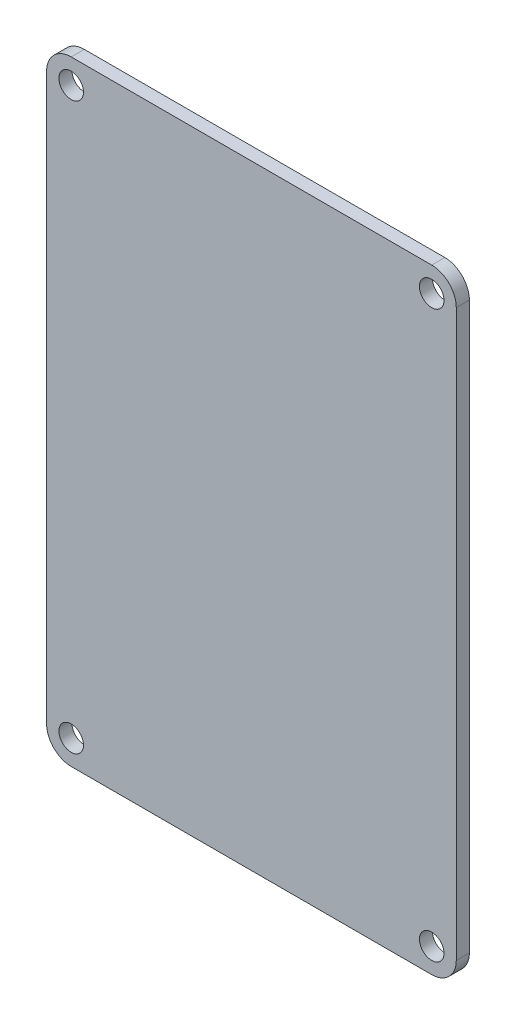
ISO-10303-21;
HEADER;
FILE_DESCRIPTION(('STEP AP214'),'2;1');
FILE_NAME('part.step','',(''),(''),'','','');
FILE_SCHEMA(('AUTOMOTIVE_DESIGN { 1 0 10303 214 1 1 1 1 }'));
ENDSEC;
DATA;
#1=APPLICATION_CONTEXT('core data for automotive mechanical design processes');
#2=APPLICATION_PROTOCOL_DEFINITION('international standard','automotive_design',2000,#1);
#3=PRODUCT_CONTEXT('',#1,'mechanical');
#4=PRODUCT('Part','Part','',(#3));
#5=PRODUCT_RELATED_PRODUCT_CATEGORY('part','',(#4));
#6=PRODUCT_DEFINITION_FORMATION('','',#4);
#7=PRODUCT_DEFINITION_CONTEXT('part definition',#1,'design');
#8=PRODUCT_DEFINITION('design','',#6,#7);
#9=PRODUCT_DEFINITION_SHAPE('','',#8);
#10=(LENGTH_UNIT() NAMED_UNIT(*) SI_UNIT(.MILLI.,.METRE.));
#11=(NAMED_UNIT(*) PLANE_ANGLE_UNIT() SI_UNIT($,.RADIAN.));
#12=(NAMED_UNIT(*) SI_UNIT($,.STERADIAN.) SOLID_ANGLE_UNIT());
#13=UNCERTAINTY_MEASURE_WITH_UNIT(LENGTH_MEASURE(1.E-05),#10,'distance_accuracy_value','');
#14=(GEOMETRIC_REPRESENTATION_CONTEXT(3) GLOBAL_UNCERTAINTY_ASSIGNED_CONTEXT((#13)) GLOBAL_UNIT_ASSIGNED_CONTEXT((#10,
#11,#12)) REPRESENTATION_CONTEXT('',''));
#15=CARTESIAN_POINT('',(0.,0.,0.));
#16=DIRECTION('',(0.,0.,1.));
#17=DIRECTION('',(1.,0.,0.));
#18=AXIS2_PLACEMENT_3D('',#15,#16,#17);
#19=CARTESIAN_POINT('',(22.,34.5,1.6));
#20=DIRECTION('',(0.,0.,-1.));
#21=DIRECTION('',(-1.,0.,0.));
#22=AXIS2_PLACEMENT_3D('',#19,#20,#21);
#23=CYLINDRICAL_SURFACE('',#22,3.);
#24=CARTESIAN_POINT('',(22.,34.5,0.));
#25=DIRECTION('',(0.,0.,1.));
#26=DIRECTION('',(1.,0.,0.));
#27=AXIS2_PLACEMENT_3D('',#24,#25,#26);
#28=CIRCLE('',#27,3.);
#29=CARTESIAN_POINT('',(25.,34.5,0.));
#30=VERTEX_POINT('',#29);
#31=CARTESIAN_POINT('',(22.,37.5,0.));
#32=VERTEX_POINT('',#31);
#33=EDGE_CURVE('E133',#30,#32,#28,.T.);
#34=ORIENTED_EDGE('',*,*,#33,.T.);
#35=DIRECTION('',(0.,0.,-1.));
#36=VECTOR('',#35,1.);
#37=CARTESIAN_POINT('',(22.,37.5,1.6));
#38=LINE('',#37,#36);
#39=CARTESIAN_POINT('',(22.,37.5,1.6));
#40=VERTEX_POINT('',#39);
#41=EDGE_CURVE('E11',#40,#32,#38,.T.);
#42=ORIENTED_EDGE('',*,*,#41,.F.);
#43=CARTESIAN_POINT('',(22.,34.5,1.6));
#44=DIRECTION('',(0.,0.,1.));
#45=DIRECTION('',(1.,0.,0.));
#46=AXIS2_PLACEMENT_3D('',#43,#44,#45);
#47=CIRCLE('',#46,3.);
#48=CARTESIAN_POINT('',(25.,34.5,1.6));
#49=VERTEX_POINT('',#48);
#50=EDGE_CURVE('E148',#49,#40,#47,.T.);
#51=ORIENTED_EDGE('',*,*,#50,.F.);
#52=DIRECTION('',(0.,0.,-1.));
#53=VECTOR('',#52,1.);
#54=CARTESIAN_POINT('',(25.,34.5,1.6));
#55=LINE('',#54,#53);
#56=EDGE_CURVE('E129',#49,#30,#55,.T.);
#57=ORIENTED_EDGE('',*,*,#56,.T.);
#58=EDGE_LOOP('',(#34,#42,#51,#57));
#59=FACE_BOUND('',#58,.T.);
#60=ADVANCED_FACE('F37',(#59),#23,.T.);
#61=CARTESIAN_POINT('',(-22.,37.5,1.6));
#62=DIRECTION('',(0.,-1.,0.));
#63=DIRECTION('',(0.,0.,-1.));
#64=AXIS2_PLACEMENT_3D('',#61,#62,#63);
#65=PLANE('',#64);
#66=DIRECTION('',(-1.,0.,0.));
#67=VECTOR('',#66,1.);
#68=CARTESIAN_POINT('',(-22.,37.5,0.));
#69=LINE('',#68,#67);
#70=CARTESIAN_POINT('',(-22.,37.5,0.));
#71=VERTEX_POINT('',#70);
#72=EDGE_CURVE('E136',#32,#71,#69,.T.);
#73=ORIENTED_EDGE('',*,*,#72,.T.);
#74=DIRECTION('',(0.,0.,-1.));
#75=VECTOR('',#74,1.);
#76=CARTESIAN_POINT('',(-22.,37.5,1.6));
#77=LINE('',#76,#75);
#78=CARTESIAN_POINT('',(-22.,37.5,1.6));
#79=VERTEX_POINT('',#78);
#80=EDGE_CURVE('E45',#79,#71,#77,.T.);
#81=ORIENTED_EDGE('',*,*,#80,.F.);
#82=DIRECTION('',(-1.,0.,0.));
#83=VECTOR('',#82,1.);
#84=CARTESIAN_POINT('',(-22.,37.5,1.6));
#85=LINE('',#84,#83);
#86=EDGE_CURVE('E96',#40,#79,#85,.T.);
#87=ORIENTED_EDGE('',*,*,#86,.F.);
#88=ORIENTED_EDGE('',*,*,#41,.T.);
#89=EDGE_LOOP('',(#73,#81,#87,#88));
#90=FACE_BOUND('',#89,.T.);
#91=ADVANCED_FACE('F230',(#90),#65,.F.);
#92=CARTESIAN_POINT('',(-22.,34.5,1.6));
#93=DIRECTION('',(0.,0.,-1.));
#94=DIRECTION('',(-1.,0.,0.));
#95=AXIS2_PLACEMENT_3D('',#92,#93,#94);
#96=CYLINDRICAL_SURFACE('',#95,3.);
#97=CARTESIAN_POINT('',(-22.,34.5,0.));
#98=DIRECTION('',(0.,0.,1.));
#99=DIRECTION('',(-1.,0.,0.));
#100=AXIS2_PLACEMENT_3D('',#97,#98,#99);
#101=CIRCLE('',#100,3.);
#102=CARTESIAN_POINT('',(-25.,34.5,0.));
#103=VERTEX_POINT('',#102);
#104=EDGE_CURVE('E139',#71,#103,#101,.T.);
#105=ORIENTED_EDGE('',*,*,#104,.T.);
#106=DIRECTION('',(0.,0.,-1.));
#107=VECTOR('',#106,1.);
#108=CARTESIAN_POINT('',(-25.,34.5,1.6));
#109=LINE('',#108,#107);
#110=CARTESIAN_POINT('',(-25.,34.5,1.6));
#111=VERTEX_POINT('',#110);
#112=EDGE_CURVE('E155',#111,#103,#109,.T.);
#113=ORIENTED_EDGE('',*,*,#112,.F.);
#114=CARTESIAN_POINT('',(-22.,34.5,1.6));
#115=DIRECTION('',(0.,0.,1.));
#116=DIRECTION('',(-1.,0.,0.));
#117=AXIS2_PLACEMENT_3D('',#114,#115,#116);
#118=CIRCLE('',#117,3.);
#119=EDGE_CURVE('E163',#79,#111,#118,.T.);
#120=ORIENTED_EDGE('',*,*,#119,.F.);
#121=ORIENTED_EDGE('',*,*,#80,.T.);
#122=EDGE_LOOP('',(#105,#113,#120,#121));
#123=FACE_BOUND('',#122,.T.);
#124=ADVANCED_FACE('F161',(#123),#96,.T.);
#125=CARTESIAN_POINT('',(-25.,-34.5,1.6));
#126=DIRECTION('',(1.,0.,0.));
#127=DIRECTION('',(0.,0.,-1.));
#128=AXIS2_PLACEMENT_3D('',#125,#126,#127);
#129=PLANE('',#128);
#130=DIRECTION('',(0.,-1.,0.));
#131=VECTOR('',#130,1.);
#132=CARTESIAN_POINT('',(-25.,-34.5,0.));
#133=LINE('',#132,#131);
#134=CARTESIAN_POINT('',(-25.,-34.5,0.));
#135=VERTEX_POINT('',#134);
#136=EDGE_CURVE('E141',#103,#135,#133,.T.);
#137=ORIENTED_EDGE('',*,*,#136,.T.);
#138=DIRECTION('',(0.,0.,-1.));
#139=VECTOR('',#138,1.);
#140=CARTESIAN_POINT('',(-25.,-34.5,1.6));
#141=LINE('',#140,#139);
#142=CARTESIAN_POINT('',(-25.,-34.5,1.6));
#143=VERTEX_POINT('',#142);
#144=EDGE_CURVE('E152',#143,#135,#141,.T.);
#145=ORIENTED_EDGE('',*,*,#144,.F.);
#146=DIRECTION('',(0.,-1.,0.));
#147=VECTOR('',#146,1.);
#148=CARTESIAN_POINT('',(-25.,-34.5,1.6));
#149=LINE('',#148,#147);
#150=EDGE_CURVE('E175',#111,#143,#149,.T.);
#151=ORIENTED_EDGE('',*,*,#150,.F.);
#152=ORIENTED_EDGE('',*,*,#112,.T.);
#153=EDGE_LOOP('',(#137,#145,#151,#152));
#154=FACE_BOUND('',#153,.T.);
#155=ADVANCED_FACE('F171',(#154),#129,.F.);
#156=CARTESIAN_POINT('',(-22.,-34.5,1.6));
#157=DIRECTION('',(0.,0.,-1.));
#158=DIRECTION('',(-1.,0.,0.));
#159=AXIS2_PLACEMENT_3D('',#156,#157,#158);
#160=CYLINDRICAL_SURFACE('',#159,3.);
#161=CARTESIAN_POINT('',(-22.,-34.5,0.));
#162=DIRECTION('',(0.,0.,1.));
#163=DIRECTION('',(-1.,0.,0.));
#164=AXIS2_PLACEMENT_3D('',#161,#162,#163);
#165=CIRCLE('',#164,3.);
#166=CARTESIAN_POINT('',(-22.,-37.5,0.));
#167=VERTEX_POINT('',#166);
#168=EDGE_CURVE('E143',#135,#167,#165,.T.);
#169=ORIENTED_EDGE('',*,*,#168,.T.);
#170=DIRECTION('',(0.,0.,-1.));
#171=VECTOR('',#170,1.);
#172=CARTESIAN_POINT('',(-22.,-37.5,1.6));
#173=LINE('',#172,#171);
#174=CARTESIAN_POINT('',(-22.,-37.5,1.6));
#175=VERTEX_POINT('',#174);
#176=EDGE_CURVE('E124',#175,#167,#173,.T.);
#177=ORIENTED_EDGE('',*,*,#176,.F.);
#178=CARTESIAN_POINT('',(-22.,-34.5,1.6));
#179=DIRECTION('',(0.,0.,1.));
#180=DIRECTION('',(-1.,0.,0.));
#181=AXIS2_PLACEMENT_3D('',#178,#179,#180);
#182=CIRCLE('',#181,3.);
#183=EDGE_CURVE('E115',#143,#175,#182,.T.);
#184=ORIENTED_EDGE('',*,*,#183,.F.);
#185=ORIENTED_EDGE('',*,*,#144,.T.);
#186=EDGE_LOOP('',(#169,#177,#184,#185));
#187=FACE_BOUND('',#186,.T.);
#188=ADVANCED_FACE('F174',(#187),#160,.T.);
#189=CARTESIAN_POINT('',(-22.,-37.5,1.6));
#190=DIRECTION('',(0.,1.,0.));
#191=DIRECTION('',(0.,0.,1.));
#192=AXIS2_PLACEMENT_3D('',#189,#190,#191);
#193=PLANE('',#192);
#194=DIRECTION('',(1.,0.,0.));
#195=VECTOR('',#194,1.);
#196=CARTESIAN_POINT('',(-22.,-37.5,0.));
#197=LINE('',#196,#195);
#198=CARTESIAN_POINT('',(22.,-37.5,0.));
#199=VERTEX_POINT('',#198);
#200=EDGE_CURVE('E123',#167,#199,#197,.T.);
#201=ORIENTED_EDGE('',*,*,#200,.T.);
#202=DIRECTION('',(0.,0.,-1.));
#203=VECTOR('',#202,1.);
#204=CARTESIAN_POINT('',(22.,-37.5,1.6));
#205=LINE('',#204,#203);
#206=CARTESIAN_POINT('',(22.,-37.5,1.6));
#207=VERTEX_POINT('',#206);
#208=EDGE_CURVE('E120',#207,#199,#205,.T.);
#209=ORIENTED_EDGE('',*,*,#208,.F.);
#210=DIRECTION('',(1.,0.,0.));
#211=VECTOR('',#210,1.);
#212=CARTESIAN_POINT('',(-22.,-37.5,1.6));
#213=LINE('',#212,#211);
#214=EDGE_CURVE('E109',#175,#207,#213,.T.);
#215=ORIENTED_EDGE('',*,*,#214,.F.);
#216=ORIENTED_EDGE('',*,*,#176,.T.);
#217=EDGE_LOOP('',(#201,#209,#215,#216));
#218=FACE_BOUND('',#217,.T.);
#219=ADVANCED_FACE('F121',(#218),#193,.F.);
#220=CARTESIAN_POINT('',(22.,-34.5,1.6));
#221=DIRECTION('',(0.,0.,-1.));
#222=DIRECTION('',(-1.,0.,0.));
#223=AXIS2_PLACEMENT_3D('',#220,#221,#222);
#224=CYLINDRICAL_SURFACE('',#223,3.);
#225=CARTESIAN_POINT('',(22.,-34.5,0.));
#226=DIRECTION('',(0.,0.,1.));
#227=DIRECTION('',(-1.,0.,0.));
#228=AXIS2_PLACEMENT_3D('',#225,#226,#227);
#229=CIRCLE('',#228,3.);
#230=CARTESIAN_POINT('',(25.,-34.5,0.));
#231=VERTEX_POINT('',#230);
#232=EDGE_CURVE('E82',#199,#231,#229,.T.);
#233=ORIENTED_EDGE('',*,*,#232,.T.);
#234=DIRECTION('',(0.,0.,-1.));
#235=VECTOR('',#234,1.);
#236=CARTESIAN_POINT('',(25.,-34.5,1.6));
#237=LINE('',#236,#235);
#238=CARTESIAN_POINT('',(25.,-34.5,1.6));
#239=VERTEX_POINT('',#238);
#240=EDGE_CURVE('E125',#239,#231,#237,.T.);
#241=ORIENTED_EDGE('',*,*,#240,.F.);
#242=CARTESIAN_POINT('',(22.,-34.5,1.6));
#243=DIRECTION('',(0.,0.,1.));
#244=DIRECTION('',(-1.,0.,0.));
#245=AXIS2_PLACEMENT_3D('',#242,#243,#244);
#246=CIRCLE('',#245,3.);
#247=EDGE_CURVE('E113',#207,#239,#246,.T.);
#248=ORIENTED_EDGE('',*,*,#247,.F.);
#249=ORIENTED_EDGE('',*,*,#208,.T.);
#250=EDGE_LOOP('',(#233,#241,#248,#249));
#251=FACE_BOUND('',#250,.T.);
#252=ADVANCED_FACE('F127',(#251),#224,.T.);
#253=CARTESIAN_POINT('',(25.,-34.5,1.6));
#254=DIRECTION('',(-1.,0.,0.));
#255=DIRECTION('',(0.,0.,1.));
#256=AXIS2_PLACEMENT_3D('',#253,#254,#255);
#257=PLANE('',#256);
#258=DIRECTION('',(0.,1.,0.));
#259=VECTOR('',#258,1.);
#260=CARTESIAN_POINT('',(25.,-34.5,0.));
#261=LINE('',#260,#259);
#262=EDGE_CURVE('E88',#231,#30,#261,.T.);
#263=ORIENTED_EDGE('',*,*,#262,.T.);
#264=ORIENTED_EDGE('',*,*,#56,.F.);
#265=DIRECTION('',(0.,1.,0.));
#266=VECTOR('',#265,1.);
#267=CARTESIAN_POINT('',(25.,-34.5,1.6));
#268=LINE('',#267,#266);
#269=EDGE_CURVE('E53',#239,#49,#268,.T.);
#270=ORIENTED_EDGE('',*,*,#269,.F.);
#271=ORIENTED_EDGE('',*,*,#240,.T.);
#272=EDGE_LOOP('',(#263,#264,#270,#271));
#273=FACE_BOUND('',#272,.T.);
#274=ADVANCED_FACE('F237',(#273),#257,.F.);
#275=CARTESIAN_POINT('',(22.,34.5,1.6));
#276=DIRECTION('',(0.,0.,1.));
#277=DIRECTION('',(1.,0.,0.));
#278=AXIS2_PLACEMENT_3D('',#275,#276,#277);
#279=PLANE('',#278);
#280=CARTESIAN_POINT('',(-22.,34.5,1.6));
#281=DIRECTION('',(0.,0.,-1.));
#282=DIRECTION('',(1.,0.,0.));
#283=AXIS2_PLACEMENT_3D('',#280,#281,#282);
#284=CIRCLE('',#283,1.5);
#285=CARTESIAN_POINT('',(-20.5,34.5,1.6));
#286=VERTEX_POINT('',#285);
#287=EDGE_CURVE('E190',#286,#286,#284,.T.);
#288=ORIENTED_EDGE('',*,*,#287,.T.);
#289=EDGE_LOOP('',(#288));
#290=FACE_BOUND('',#289,.T.);
#291=CARTESIAN_POINT('',(22.,-34.5,1.6));
#292=DIRECTION('',(0.,0.,-1.));
#293=DIRECTION('',(1.,0.,0.));
#294=AXIS2_PLACEMENT_3D('',#291,#292,#293);
#295=CIRCLE('',#294,1.5);
#296=CARTESIAN_POINT('',(23.5,-34.5,1.6));
#297=VERTEX_POINT('',#296);
#298=EDGE_CURVE('E196',#297,#297,#295,.T.);
#299=ORIENTED_EDGE('',*,*,#298,.T.);
#300=EDGE_LOOP('',(#299));
#301=FACE_BOUND('',#300,.T.);
#302=CARTESIAN_POINT('',(-22.,-34.5,1.6));
#303=DIRECTION('',(0.,0.,-1.));
#304=DIRECTION('',(-1.,0.,0.));
#305=AXIS2_PLACEMENT_3D('',#302,#303,#304);
#306=CIRCLE('',#305,1.5);
#307=CARTESIAN_POINT('',(-23.5,-34.5,1.6));
#308=VERTEX_POINT('',#307);
#309=EDGE_CURVE('E184',#308,#308,#306,.T.);
#310=ORIENTED_EDGE('',*,*,#309,.T.);
#311=EDGE_LOOP('',(#310));
#312=FACE_BOUND('',#311,.T.);
#313=CARTESIAN_POINT('',(22.,34.5,1.6));
#314=DIRECTION('',(0.,0.,-1.));
#315=DIRECTION('',(-1.,0.,0.));
#316=AXIS2_PLACEMENT_3D('',#313,#314,#315);
#317=CIRCLE('',#316,1.5);
#318=CARTESIAN_POINT('',(20.5,34.5,1.6));
#319=VERTEX_POINT('',#318);
#320=EDGE_CURVE('E137',#319,#319,#317,.T.);
#321=ORIENTED_EDGE('',*,*,#320,.T.);
#322=EDGE_LOOP('',(#321));
#323=FACE_BOUND('',#322,.T.);
#324=ORIENTED_EDGE('',*,*,#50,.T.);
#325=ORIENTED_EDGE('',*,*,#86,.T.);
#326=ORIENTED_EDGE('',*,*,#119,.T.);
#327=ORIENTED_EDGE('',*,*,#150,.T.);
#328=ORIENTED_EDGE('',*,*,#183,.T.);
#329=ORIENTED_EDGE('',*,*,#214,.T.);
#330=ORIENTED_EDGE('',*,*,#247,.T.);
#331=ORIENTED_EDGE('',*,*,#269,.T.);
#332=EDGE_LOOP('',(#324,#325,#326,#327,#328,#329,#330,#331));
#333=FACE_BOUND('',#332,.T.);
#334=ADVANCED_FACE('F111',(#290,#301,#312,#323,#333),#279,.T.);
#335=CARTESIAN_POINT('',(22.,34.5,0.));
#336=DIRECTION('',(0.,0.,1.));
#337=DIRECTION('',(1.,0.,0.));
#338=AXIS2_PLACEMENT_3D('',#335,#336,#337);
#339=PLANE('',#338);
#340=CARTESIAN_POINT('',(-22.,34.5,0.));
#341=DIRECTION('',(0.,0.,-1.));
#342=DIRECTION('',(1.,0.,0.));
#343=AXIS2_PLACEMENT_3D('',#340,#341,#342);
#344=CIRCLE('',#343,1.5);
#345=CARTESIAN_POINT('',(-20.5,34.5,0.));
#346=VERTEX_POINT('',#345);
#347=EDGE_CURVE('E187',#346,#346,#344,.T.);
#348=ORIENTED_EDGE('',*,*,#347,.F.);
#349=EDGE_LOOP('',(#348));
#350=FACE_BOUND('',#349,.T.);
#351=CARTESIAN_POINT('',(22.,-34.5,0.));
#352=DIRECTION('',(0.,0.,-1.));
#353=DIRECTION('',(1.,0.,0.));
#354=AXIS2_PLACEMENT_3D('',#351,#352,#353);
#355=CIRCLE('',#354,1.5);
#356=CARTESIAN_POINT('',(23.5,-34.5,0.));
#357=VERTEX_POINT('',#356);
#358=EDGE_CURVE('E193',#357,#357,#355,.T.);
#359=ORIENTED_EDGE('',*,*,#358,.F.);
#360=EDGE_LOOP('',(#359));
#361=FACE_BOUND('',#360,.T.);
#362=CARTESIAN_POINT('',(-22.,-34.5,0.));
#363=DIRECTION('',(0.,0.,-1.));
#364=DIRECTION('',(-1.,0.,0.));
#365=AXIS2_PLACEMENT_3D('',#362,#363,#364);
#366=CIRCLE('',#365,1.5);
#367=CARTESIAN_POINT('',(-23.5,-34.5,0.));
#368=VERTEX_POINT('',#367);
#369=EDGE_CURVE('E199',#368,#368,#366,.T.);
#370=ORIENTED_EDGE('',*,*,#369,.F.);
#371=EDGE_LOOP('',(#370));
#372=FACE_BOUND('',#371,.T.);
#373=CARTESIAN_POINT('',(22.,34.5,0.));
#374=DIRECTION('',(0.,0.,-1.));
#375=DIRECTION('',(-1.,0.,0.));
#376=AXIS2_PLACEMENT_3D('',#373,#374,#375);
#377=CIRCLE('',#376,1.5);
#378=CARTESIAN_POINT('',(20.5,34.5,0.));
#379=VERTEX_POINT('',#378);
#380=EDGE_CURVE('E181',#379,#379,#377,.T.);
#381=ORIENTED_EDGE('',*,*,#380,.F.);
#382=EDGE_LOOP('',(#381));
#383=FACE_BOUND('',#382,.T.);
#384=ORIENTED_EDGE('',*,*,#33,.F.);
#385=ORIENTED_EDGE('',*,*,#262,.F.);
#386=ORIENTED_EDGE('',*,*,#232,.F.);
#387=ORIENTED_EDGE('',*,*,#200,.F.);
#388=ORIENTED_EDGE('',*,*,#168,.F.);
#389=ORIENTED_EDGE('',*,*,#136,.F.);
#390=ORIENTED_EDGE('',*,*,#104,.F.);
#391=ORIENTED_EDGE('',*,*,#72,.F.);
#392=EDGE_LOOP('',(#384,#385,#386,#387,#388,#389,#390,#391));
#393=FACE_BOUND('',#392,.T.);
#394=ADVANCED_FACE('F167',(#350,#361,#372,#383,#393),#339,.F.);
#395=CARTESIAN_POINT('',(22.,34.5,1.6));
#396=DIRECTION('',(0.,0.,-1.));
#397=DIRECTION('',(-1.,0.,0.));
#398=AXIS2_PLACEMENT_3D('',#395,#396,#397);
#399=CYLINDRICAL_SURFACE('',#398,1.5);
#400=ORIENTED_EDGE('',*,*,#320,.F.);
#401=EDGE_LOOP('',(#400));
#402=FACE_BOUND('',#401,.T.);
#403=ORIENTED_EDGE('',*,*,#380,.T.);
#404=EDGE_LOOP('',(#403));
#405=FACE_BOUND('',#404,.T.);
#406=ADVANCED_FACE('F211',(#402,#405),#399,.F.);
#407=CARTESIAN_POINT('',(-22.,-34.5,1.6));
#408=DIRECTION('',(0.,0.,-1.));
#409=DIRECTION('',(-1.,0.,0.));
#410=AXIS2_PLACEMENT_3D('',#407,#408,#409);
#411=CYLINDRICAL_SURFACE('',#410,1.5);
#412=ORIENTED_EDGE('',*,*,#309,.F.);
#413=EDGE_LOOP('',(#412));
#414=FACE_BOUND('',#413,.T.);
#415=ORIENTED_EDGE('',*,*,#369,.T.);
#416=EDGE_LOOP('',(#415));
#417=FACE_BOUND('',#416,.T.);
#418=ADVANCED_FACE('F207',(#414,#417),#411,.F.);
#419=CARTESIAN_POINT('',(22.,-34.5,1.6));
#420=DIRECTION('',(0.,0.,-1.));
#421=DIRECTION('',(-1.,0.,0.));
#422=AXIS2_PLACEMENT_3D('',#419,#420,#421);
#423=CYLINDRICAL_SURFACE('',#422,1.5);
#424=ORIENTED_EDGE('',*,*,#298,.F.);
#425=EDGE_LOOP('',(#424));
#426=FACE_BOUND('',#425,.T.);
#427=ORIENTED_EDGE('',*,*,#358,.T.);
#428=EDGE_LOOP('',(#427));
#429=FACE_BOUND('',#428,.T.);
#430=ADVANCED_FACE('F210',(#426,#429),#423,.F.);
#431=CARTESIAN_POINT('',(-22.,34.5,1.6));
#432=DIRECTION('',(0.,0.,-1.));
#433=DIRECTION('',(-1.,0.,0.));
#434=AXIS2_PLACEMENT_3D('',#431,#432,#433);
#435=CYLINDRICAL_SURFACE('',#434,1.5);
#436=ORIENTED_EDGE('',*,*,#287,.F.);
#437=EDGE_LOOP('',(#436));
#438=FACE_BOUND('',#437,.T.);
#439=ORIENTED_EDGE('',*,*,#347,.T.);
#440=EDGE_LOOP('',(#439));
#441=FACE_BOUND('',#440,.T.);
#442=ADVANCED_FACE('F309',(#438,#441),#435,.F.);
#443=CLOSED_SHELL('',(#60,#91,#124,#155,#188,#219,#252,#274,#334,#394,#406,#418,#430,#442));
#444=MANIFOLD_SOLID_BREP('B2',#443);
#445=ADVANCED_BREP_SHAPE_REPRESENTATION('',(#18,#444),#14);
#446=SHAPE_DEFINITION_REPRESENTATION(#9,#445);
ENDSEC;
END-ISO-10303-21;
